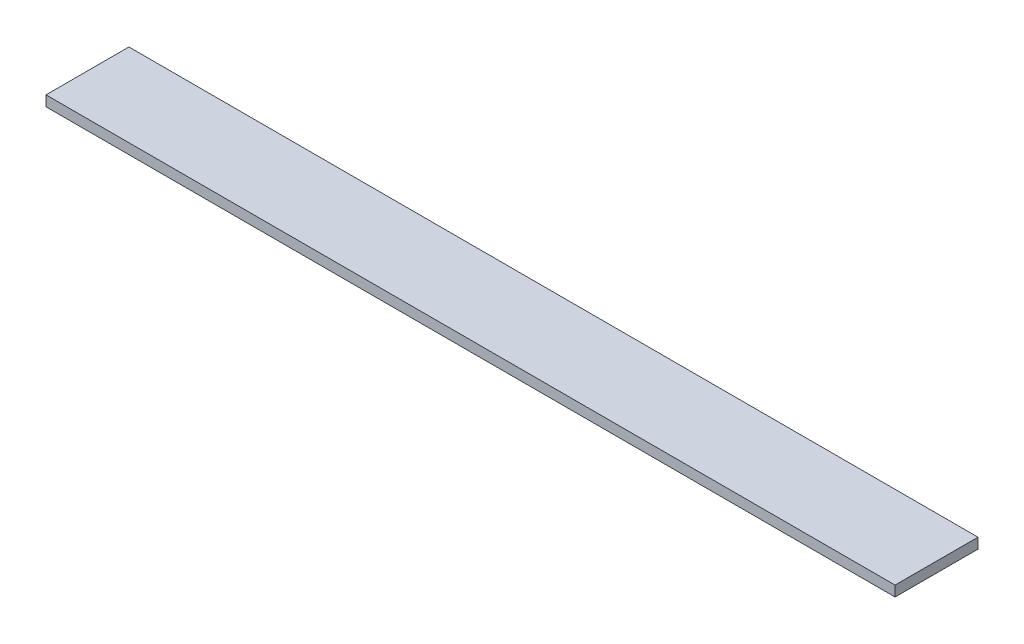
ISO-10303-21;
HEADER;
FILE_DESCRIPTION(('STEP AP214'),'2;1');
FILE_NAME('part.step','',(''),(''),'','','');
FILE_SCHEMA(('AUTOMOTIVE_DESIGN { 1 0 10303 214 1 1 1 1 }'));
ENDSEC;
DATA;
#1=APPLICATION_CONTEXT('core data for automotive mechanical design processes');
#2=APPLICATION_PROTOCOL_DEFINITION('international standard','automotive_design',2000,#1);
#3=PRODUCT_CONTEXT('',#1,'mechanical');
#4=PRODUCT('Part','Part','',(#3));
#5=PRODUCT_RELATED_PRODUCT_CATEGORY('part','',(#4));
#6=PRODUCT_DEFINITION_FORMATION('','',#4);
#7=PRODUCT_DEFINITION_CONTEXT('part definition',#1,'design');
#8=PRODUCT_DEFINITION('design','',#6,#7);
#9=PRODUCT_DEFINITION_SHAPE('','',#8);
#10=(LENGTH_UNIT() NAMED_UNIT(*) SI_UNIT(.MILLI.,.METRE.));
#11=(NAMED_UNIT(*) PLANE_ANGLE_UNIT() SI_UNIT($,.RADIAN.));
#12=(NAMED_UNIT(*) SI_UNIT($,.STERADIAN.) SOLID_ANGLE_UNIT());
#13=UNCERTAINTY_MEASURE_WITH_UNIT(LENGTH_MEASURE(1.E-05),#10,'distance_accuracy_value','');
#14=(GEOMETRIC_REPRESENTATION_CONTEXT(3) GLOBAL_UNCERTAINTY_ASSIGNED_CONTEXT((#13)) GLOBAL_UNIT_ASSIGNED_CONTEXT((#10,
#11,#12)) REPRESENTATION_CONTEXT('',''));
#15=CARTESIAN_POINT('',(0.,0.,0.));
#16=DIRECTION('',(0.,0.,1.));
#17=DIRECTION('',(1.,0.,0.));
#18=AXIS2_PLACEMENT_3D('',#15,#16,#17);
#19=CARTESIAN_POINT('',(0.,3.175,0.));
#20=DIRECTION('',(1.,0.,0.));
#21=DIRECTION('',(0.,0.,-1.));
#22=AXIS2_PLACEMENT_3D('',#19,#20,#21);
#23=PLANE('',#22);
#24=DIRECTION('',(0.,0.,1.));
#25=VECTOR('',#24,1.);
#26=CARTESIAN_POINT('',(0.,0.,0.));
#27=LINE('',#26,#25);
#28=CARTESIAN_POINT('',(0.,0.,-25.4));
#29=VERTEX_POINT('',#28);
#30=CARTESIAN_POINT('',(0.,0.,0.));
#31=VERTEX_POINT('',#30);
#32=EDGE_CURVE('E104',#29,#31,#27,.T.);
#33=ORIENTED_EDGE('',*,*,#32,.T.);
#34=DIRECTION('',(0.,-1.,0.));
#35=VECTOR('',#34,1.);
#36=CARTESIAN_POINT('',(0.,3.175,0.));
#37=LINE('',#36,#35);
#38=CARTESIAN_POINT('',(0.,3.175,0.));
#39=VERTEX_POINT('',#38);
#40=EDGE_CURVE('E11',#39,#31,#37,.T.);
#41=ORIENTED_EDGE('',*,*,#40,.F.);
#42=DIRECTION('',(0.,0.,1.));
#43=VECTOR('',#42,1.);
#44=CARTESIAN_POINT('',(0.,3.175,0.));
#45=LINE('',#44,#43);
#46=CARTESIAN_POINT('',(0.,3.175,-25.4));
#47=VERTEX_POINT('',#46);
#48=EDGE_CURVE('E92',#47,#39,#45,.T.);
#49=ORIENTED_EDGE('',*,*,#48,.F.);
#50=DIRECTION('',(0.,-1.,0.));
#51=VECTOR('',#50,1.);
#52=CARTESIAN_POINT('',(0.,3.175,-25.4));
#53=LINE('',#52,#51);
#54=EDGE_CURVE('E100',#47,#29,#53,.T.);
#55=ORIENTED_EDGE('',*,*,#54,.T.);
#56=EDGE_LOOP('',(#33,#41,#49,#55));
#57=FACE_BOUND('',#56,.T.);
#58=ADVANCED_FACE('F41',(#57),#23,.F.);
#59=CARTESIAN_POINT('',(0.,3.175,0.));
#60=DIRECTION('',(0.,0.,-1.));
#61=DIRECTION('',(-1.,0.,0.));
#62=AXIS2_PLACEMENT_3D('',#59,#60,#61);
#63=PLANE('',#62);
#64=DIRECTION('',(1.,0.,0.));
#65=VECTOR('',#64,1.);
#66=CARTESIAN_POINT('',(0.,0.,0.));
#67=LINE('',#66,#65);
#68=CARTESIAN_POINT('',(260.096,0.,0.));
#69=VERTEX_POINT('',#68);
#70=EDGE_CURVE('E96',#31,#69,#67,.T.);
#71=ORIENTED_EDGE('',*,*,#70,.T.);
#72=DIRECTION('',(0.,-1.,0.));
#73=VECTOR('',#72,1.);
#74=CARTESIAN_POINT('',(260.096,3.175,0.));
#75=LINE('',#74,#73);
#76=CARTESIAN_POINT('',(260.096,3.175,0.));
#77=VERTEX_POINT('',#76);
#78=EDGE_CURVE('E49',#77,#69,#75,.T.);
#79=ORIENTED_EDGE('',*,*,#78,.F.);
#80=DIRECTION('',(1.,0.,0.));
#81=VECTOR('',#80,1.);
#82=CARTESIAN_POINT('',(0.,3.175,0.));
#83=LINE('',#82,#81);
#84=EDGE_CURVE('E87',#39,#77,#83,.T.);
#85=ORIENTED_EDGE('',*,*,#84,.F.);
#86=ORIENTED_EDGE('',*,*,#40,.T.);
#87=EDGE_LOOP('',(#71,#79,#85,#86));
#88=FACE_BOUND('',#87,.T.);
#89=ADVANCED_FACE('F95',(#88),#63,.F.);
#90=CARTESIAN_POINT('',(260.096,3.175,0.));
#91=DIRECTION('',(-1.,0.,0.));
#92=DIRECTION('',(0.,0.,1.));
#93=AXIS2_PLACEMENT_3D('',#90,#91,#92);
#94=PLANE('',#93);
#95=DIRECTION('',(0.,0.,-1.));
#96=VECTOR('',#95,1.);
#97=CARTESIAN_POINT('',(260.096,0.,0.));
#98=LINE('',#97,#96);
#99=CARTESIAN_POINT('',(260.096,0.,-25.4));
#100=VERTEX_POINT('',#99);
#101=EDGE_CURVE('E74',#69,#100,#98,.T.);
#102=ORIENTED_EDGE('',*,*,#101,.T.);
#103=DIRECTION('',(0.,-1.,0.));
#104=VECTOR('',#103,1.);
#105=CARTESIAN_POINT('',(260.096,3.175,-25.4));
#106=LINE('',#105,#104);
#107=CARTESIAN_POINT('',(260.096,3.175,-25.4));
#108=VERTEX_POINT('',#107);
#109=EDGE_CURVE('E97',#108,#100,#106,.T.);
#110=ORIENTED_EDGE('',*,*,#109,.F.);
#111=DIRECTION('',(0.,0.,-1.));
#112=VECTOR('',#111,1.);
#113=CARTESIAN_POINT('',(260.096,3.175,0.));
#114=LINE('',#113,#112);
#115=EDGE_CURVE('E90',#77,#108,#114,.T.);
#116=ORIENTED_EDGE('',*,*,#115,.F.);
#117=ORIENTED_EDGE('',*,*,#78,.T.);
#118=EDGE_LOOP('',(#102,#110,#116,#117));
#119=FACE_BOUND('',#118,.T.);
#120=ADVANCED_FACE('F98',(#119),#94,.F.);
#121=CARTESIAN_POINT('',(0.,3.175,-25.4));
#122=DIRECTION('',(0.,0.,1.));
#123=DIRECTION('',(1.,0.,0.));
#124=AXIS2_PLACEMENT_3D('',#121,#122,#123);
#125=PLANE('',#124);
#126=DIRECTION('',(-1.,0.,0.));
#127=VECTOR('',#126,1.);
#128=CARTESIAN_POINT('',(0.,0.,-25.4));
#129=LINE('',#128,#127);
#130=EDGE_CURVE('E80',#100,#29,#129,.T.);
#131=ORIENTED_EDGE('',*,*,#130,.T.);
#132=ORIENTED_EDGE('',*,*,#54,.F.);
#133=DIRECTION('',(-1.,0.,0.));
#134=VECTOR('',#133,1.);
#135=CARTESIAN_POINT('',(0.,3.175,-25.4));
#136=LINE('',#135,#134);
#137=EDGE_CURVE('E57',#108,#47,#136,.T.);
#138=ORIENTED_EDGE('',*,*,#137,.F.);
#139=ORIENTED_EDGE('',*,*,#109,.T.);
#140=EDGE_LOOP('',(#131,#132,#138,#139));
#141=FACE_BOUND('',#140,.T.);
#142=ADVANCED_FACE('F111',(#141),#125,.F.);
#143=CARTESIAN_POINT('',(0.,3.175,0.));
#144=DIRECTION('',(0.,-1.,0.));
#145=DIRECTION('',(0.,0.,-1.));
#146=AXIS2_PLACEMENT_3D('',#143,#144,#145);
#147=PLANE('',#146);
#148=ORIENTED_EDGE('',*,*,#48,.T.);
#149=ORIENTED_EDGE('',*,*,#84,.T.);
#150=ORIENTED_EDGE('',*,*,#115,.T.);
#151=ORIENTED_EDGE('',*,*,#137,.T.);
#152=EDGE_LOOP('',(#148,#149,#150,#151));
#153=FACE_BOUND('',#152,.T.);
#154=ADVANCED_FACE('F88',(#153),#147,.F.);
#155=CARTESIAN_POINT('',(0.,0.,0.));
#156=DIRECTION('',(0.,-1.,0.));
#157=DIRECTION('',(0.,0.,-1.));
#158=AXIS2_PLACEMENT_3D('',#155,#156,#157);
#159=PLANE('',#158);
#160=ORIENTED_EDGE('',*,*,#32,.F.);
#161=ORIENTED_EDGE('',*,*,#130,.F.);
#162=ORIENTED_EDGE('',*,*,#101,.F.);
#163=ORIENTED_EDGE('',*,*,#70,.F.);
#164=EDGE_LOOP('',(#160,#161,#162,#163));
#165=FACE_BOUND('',#164,.T.);
#166=ADVANCED_FACE('F114',(#165),#159,.T.);
#167=CLOSED_SHELL('',(#58,#89,#120,#142,#154,#166));
#168=MANIFOLD_SOLID_BREP('B2',#167);
#169=ADVANCED_BREP_SHAPE_REPRESENTATION('',(#18,#168),#14);
#170=SHAPE_DEFINITION_REPRESENTATION(#9,#169);
ENDSEC;
END-ISO-10303-21;
